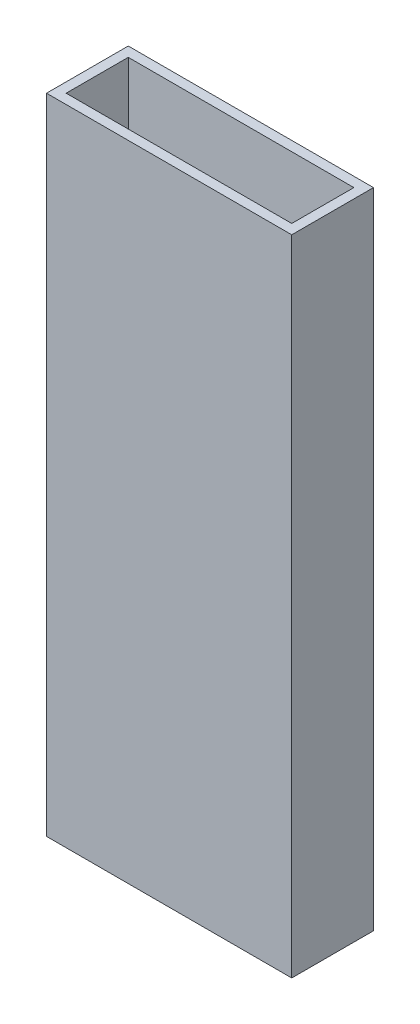
ISO-10303-21;
HEADER;
FILE_DESCRIPTION(('STEP AP214'),'2;1');
FILE_NAME('part.step','',(''),(''),'','','');
FILE_SCHEMA(('AUTOMOTIVE_DESIGN { 1 0 10303 214 1 1 1 1 }'));
ENDSEC;
DATA;
#1=APPLICATION_CONTEXT('core data for automotive mechanical design processes');
#2=APPLICATION_PROTOCOL_DEFINITION('international standard','automotive_design',2000,#1);
#3=PRODUCT_CONTEXT('',#1,'mechanical');
#4=PRODUCT('Part','Part','',(#3));
#5=PRODUCT_RELATED_PRODUCT_CATEGORY('part','',(#4));
#6=PRODUCT_DEFINITION_FORMATION('','',#4);
#7=PRODUCT_DEFINITION_CONTEXT('part definition',#1,'design');
#8=PRODUCT_DEFINITION('design','',#6,#7);
#9=PRODUCT_DEFINITION_SHAPE('','',#8);
#10=(LENGTH_UNIT() NAMED_UNIT(*) SI_UNIT(.MILLI.,.METRE.));
#11=(NAMED_UNIT(*) PLANE_ANGLE_UNIT() SI_UNIT($,.RADIAN.));
#12=(NAMED_UNIT(*) SI_UNIT($,.STERADIAN.) SOLID_ANGLE_UNIT());
#13=UNCERTAINTY_MEASURE_WITH_UNIT(LENGTH_MEASURE(1.E-05),#10,'distance_accuracy_value','');
#14=(GEOMETRIC_REPRESENTATION_CONTEXT(3) GLOBAL_UNCERTAINTY_ASSIGNED_CONTEXT((#13)) GLOBAL_UNIT_ASSIGNED_CONTEXT((#10,
#11,#12)) REPRESENTATION_CONTEXT('',''));
#15=CARTESIAN_POINT('',(0.,0.,0.));
#16=DIRECTION('',(0.,0.,1.));
#17=DIRECTION('',(1.,0.,0.));
#18=AXIS2_PLACEMENT_3D('',#15,#16,#17);
#19=CARTESIAN_POINT('',(0.,200.,0.));
#20=DIRECTION('',(0.,1.,0.));
#21=DIRECTION('',(0.,0.,1.));
#22=AXIS2_PLACEMENT_3D('',#19,#20,#21);
#23=PLANE('',#22);
#24=DIRECTION('',(0.,0.,1.));
#25=VECTOR('',#24,1.);
#26=CARTESIAN_POINT('',(-38.1,200.,-12.7));
#27=LINE('',#26,#25);
#28=CARTESIAN_POINT('',(-38.1,200.,-12.7));
#29=VERTEX_POINT('',#28);
#30=CARTESIAN_POINT('',(-38.1,200.,12.7));
#31=VERTEX_POINT('',#30);
#32=EDGE_CURVE('E153',#29,#31,#27,.T.);
#33=ORIENTED_EDGE('',*,*,#32,.T.);
#34=DIRECTION('',(1.,0.,0.));
#35=VECTOR('',#34,1.);
#36=CARTESIAN_POINT('',(-38.1,200.,12.7));
#37=LINE('',#36,#35);
#38=CARTESIAN_POINT('',(38.1,200.,12.7));
#39=VERTEX_POINT('',#38);
#40=EDGE_CURVE('E157',#31,#39,#37,.T.);
#41=ORIENTED_EDGE('',*,*,#40,.T.);
#42=DIRECTION('',(0.,0.,-1.));
#43=VECTOR('',#42,1.);
#44=CARTESIAN_POINT('',(38.1,200.,-12.7));
#45=LINE('',#44,#43);
#46=CARTESIAN_POINT('',(38.1,200.,-12.7));
#47=VERTEX_POINT('',#46);
#48=EDGE_CURVE('E161',#39,#47,#45,.T.);
#49=ORIENTED_EDGE('',*,*,#48,.T.);
#50=DIRECTION('',(-1.,0.,0.));
#51=VECTOR('',#50,1.);
#52=CARTESIAN_POINT('',(-38.1,200.,-12.7));
#53=LINE('',#52,#51);
#54=EDGE_CURVE('E164',#47,#29,#53,.T.);
#55=ORIENTED_EDGE('',*,*,#54,.T.);
#56=EDGE_LOOP('',(#33,#41,#49,#55));
#57=FACE_BOUND('',#56,.T.);
#58=DIRECTION('',(1.,0.,0.));
#59=VECTOR('',#58,1.);
#60=CARTESIAN_POINT('',(-35.052,200.,9.652));
#61=LINE('',#60,#59);
#62=CARTESIAN_POINT('',(-35.052,200.,9.652));
#63=VERTEX_POINT('',#62);
#64=CARTESIAN_POINT('',(35.052,200.,9.65199999999999));
#65=VERTEX_POINT('',#64);
#66=EDGE_CURVE('E114',#63,#65,#61,.T.);
#67=ORIENTED_EDGE('',*,*,#66,.F.);
#68=DIRECTION('',(0.,0.,1.));
#69=VECTOR('',#68,1.);
#70=CARTESIAN_POINT('',(-35.052,200.,-9.65199999999999));
#71=LINE('',#70,#69);
#72=CARTESIAN_POINT('',(-35.052,200.,-9.65199999999999));
#73=VERTEX_POINT('',#72);
#74=EDGE_CURVE('E105',#73,#63,#71,.T.);
#75=ORIENTED_EDGE('',*,*,#74,.F.);
#76=DIRECTION('',(-1.,0.,0.));
#77=VECTOR('',#76,1.);
#78=CARTESIAN_POINT('',(-35.052,200.,-9.65199999999999));
#79=LINE('',#78,#77);
#80=CARTESIAN_POINT('',(35.052,200.,-9.652));
#81=VERTEX_POINT('',#80);
#82=EDGE_CURVE('E131',#81,#73,#79,.T.);
#83=ORIENTED_EDGE('',*,*,#82,.F.);
#84=DIRECTION('',(0.,0.,-1.));
#85=VECTOR('',#84,1.);
#86=CARTESIAN_POINT('',(35.052,200.,-9.652));
#87=LINE('',#86,#85);
#88=EDGE_CURVE('E127',#65,#81,#87,.T.);
#89=ORIENTED_EDGE('',*,*,#88,.F.);
#90=EDGE_LOOP('',(#67,#75,#83,#89));
#91=FACE_BOUND('',#90,.T.);
#92=ADVANCED_FACE('F39',(#57,#91),#23,.T.);
#93=CARTESIAN_POINT('',(0.,0.,0.));
#94=DIRECTION('',(0.,1.,0.));
#95=DIRECTION('',(0.,0.,1.));
#96=AXIS2_PLACEMENT_3D('',#93,#94,#95);
#97=PLANE('',#96);
#98=DIRECTION('',(0.,0.,1.));
#99=VECTOR('',#98,1.);
#100=CARTESIAN_POINT('',(-38.1,0.,-12.7));
#101=LINE('',#100,#99);
#102=CARTESIAN_POINT('',(-38.1,0.,-12.7));
#103=VERTEX_POINT('',#102);
#104=CARTESIAN_POINT('',(-38.1,0.,12.7));
#105=VERTEX_POINT('',#104);
#106=EDGE_CURVE('E123',#103,#105,#101,.T.);
#107=ORIENTED_EDGE('',*,*,#106,.F.);
#108=DIRECTION('',(-1.,0.,0.));
#109=VECTOR('',#108,1.);
#110=CARTESIAN_POINT('',(-38.1,0.,-12.7));
#111=LINE('',#110,#109);
#112=CARTESIAN_POINT('',(38.1,0.,-12.7));
#113=VERTEX_POINT('',#112);
#114=EDGE_CURVE('E158',#113,#103,#111,.T.);
#115=ORIENTED_EDGE('',*,*,#114,.F.);
#116=DIRECTION('',(0.,0.,-1.));
#117=VECTOR('',#116,1.);
#118=CARTESIAN_POINT('',(38.1,0.,-12.7));
#119=LINE('',#118,#117);
#120=CARTESIAN_POINT('',(38.1,0.,12.7));
#121=VERTEX_POINT('',#120);
#122=EDGE_CURVE('E174',#121,#113,#119,.T.);
#123=ORIENTED_EDGE('',*,*,#122,.F.);
#124=DIRECTION('',(1.,0.,0.));
#125=VECTOR('',#124,1.);
#126=CARTESIAN_POINT('',(-38.1,0.,12.7));
#127=LINE('',#126,#125);
#128=EDGE_CURVE('E171',#105,#121,#127,.T.);
#129=ORIENTED_EDGE('',*,*,#128,.F.);
#130=EDGE_LOOP('',(#107,#115,#123,#129));
#131=FACE_BOUND('',#130,.T.);
#132=DIRECTION('',(0.,0.,1.));
#133=VECTOR('',#132,1.);
#134=CARTESIAN_POINT('',(-35.052,0.,-9.65199999999999));
#135=LINE('',#134,#133);
#136=CARTESIAN_POINT('',(-35.052,0.,-9.65199999999999));
#137=VERTEX_POINT('',#136);
#138=CARTESIAN_POINT('',(-35.052,0.,9.652));
#139=VERTEX_POINT('',#138);
#140=EDGE_CURVE('E63',#137,#139,#135,.T.);
#141=ORIENTED_EDGE('',*,*,#140,.T.);
#142=DIRECTION('',(1.,0.,0.));
#143=VECTOR('',#142,1.);
#144=CARTESIAN_POINT('',(-35.052,0.,9.652));
#145=LINE('',#144,#143);
#146=CARTESIAN_POINT('',(35.052,0.,9.65199999999999));
#147=VERTEX_POINT('',#146);
#148=EDGE_CURVE('E121',#139,#147,#145,.T.);
#149=ORIENTED_EDGE('',*,*,#148,.T.);
#150=DIRECTION('',(0.,0.,-1.));
#151=VECTOR('',#150,1.);
#152=CARTESIAN_POINT('',(35.052,0.,-9.652));
#153=LINE('',#152,#151);
#154=CARTESIAN_POINT('',(35.052,0.,-9.652));
#155=VERTEX_POINT('',#154);
#156=EDGE_CURVE('E140',#147,#155,#153,.T.);
#157=ORIENTED_EDGE('',*,*,#156,.T.);
#158=DIRECTION('',(-1.,0.,0.));
#159=VECTOR('',#158,1.);
#160=CARTESIAN_POINT('',(-35.052,0.,-9.65199999999999));
#161=LINE('',#160,#159);
#162=EDGE_CURVE('E115',#155,#137,#161,.T.);
#163=ORIENTED_EDGE('',*,*,#162,.T.);
#164=EDGE_LOOP('',(#141,#149,#157,#163));
#165=FACE_BOUND('',#164,.T.);
#166=ADVANCED_FACE('F197',(#131,#165),#97,.F.);
#167=CARTESIAN_POINT('',(-38.1,200.,-12.7));
#168=DIRECTION('',(1.,0.,0.));
#169=DIRECTION('',(0.,0.,-1.));
#170=AXIS2_PLACEMENT_3D('',#167,#168,#169);
#171=PLANE('',#170);
#172=ORIENTED_EDGE('',*,*,#106,.T.);
#173=DIRECTION('',(0.,-1.,0.));
#174=VECTOR('',#173,1.);
#175=CARTESIAN_POINT('',(-38.1,200.,12.7));
#176=LINE('',#175,#174);
#177=EDGE_CURVE('E11',#31,#105,#176,.T.);
#178=ORIENTED_EDGE('',*,*,#177,.F.);
#179=ORIENTED_EDGE('',*,*,#32,.F.);
#180=DIRECTION('',(0.,-1.,0.));
#181=VECTOR('',#180,1.);
#182=CARTESIAN_POINT('',(-38.1,200.,-12.7));
#183=LINE('',#182,#181);
#184=EDGE_CURVE('E167',#29,#103,#183,.T.);
#185=ORIENTED_EDGE('',*,*,#184,.T.);
#186=EDGE_LOOP('',(#172,#178,#179,#185));
#187=FACE_BOUND('',#186,.T.);
#188=ADVANCED_FACE('F41',(#187),#171,.F.);
#189=CARTESIAN_POINT('',(-38.1,200.,12.7));
#190=DIRECTION('',(0.,0.,-1.));
#191=DIRECTION('',(-1.,0.,0.));
#192=AXIS2_PLACEMENT_3D('',#189,#190,#191);
#193=PLANE('',#192);
#194=ORIENTED_EDGE('',*,*,#128,.T.);
#195=DIRECTION('',(0.,-1.,0.));
#196=VECTOR('',#195,1.);
#197=CARTESIAN_POINT('',(38.1,200.,12.7));
#198=LINE('',#197,#196);
#199=EDGE_CURVE('E48',#39,#121,#198,.T.);
#200=ORIENTED_EDGE('',*,*,#199,.F.);
#201=ORIENTED_EDGE('',*,*,#40,.F.);
#202=ORIENTED_EDGE('',*,*,#177,.T.);
#203=EDGE_LOOP('',(#194,#200,#201,#202));
#204=FACE_BOUND('',#203,.T.);
#205=ADVANCED_FACE('F207',(#204),#193,.F.);
#206=CARTESIAN_POINT('',(38.1,200.,-12.7));
#207=DIRECTION('',(-1.,0.,0.));
#208=DIRECTION('',(0.,0.,1.));
#209=AXIS2_PLACEMENT_3D('',#206,#207,#208);
#210=PLANE('',#209);
#211=ORIENTED_EDGE('',*,*,#122,.T.);
#212=DIRECTION('',(0.,-1.,0.));
#213=VECTOR('',#212,1.);
#214=CARTESIAN_POINT('',(38.1,200.,-12.7));
#215=LINE('',#214,#213);
#216=EDGE_CURVE('E182',#47,#113,#215,.T.);
#217=ORIENTED_EDGE('',*,*,#216,.F.);
#218=ORIENTED_EDGE('',*,*,#48,.F.);
#219=ORIENTED_EDGE('',*,*,#199,.T.);
#220=EDGE_LOOP('',(#211,#217,#218,#219));
#221=FACE_BOUND('',#220,.T.);
#222=ADVANCED_FACE('F191',(#221),#210,.F.);
#223=CARTESIAN_POINT('',(-38.1,200.,-12.7));
#224=DIRECTION('',(0.,0.,1.));
#225=DIRECTION('',(1.,0.,0.));
#226=AXIS2_PLACEMENT_3D('',#223,#224,#225);
#227=PLANE('',#226);
#228=ORIENTED_EDGE('',*,*,#114,.T.);
#229=ORIENTED_EDGE('',*,*,#184,.F.);
#230=ORIENTED_EDGE('',*,*,#54,.F.);
#231=ORIENTED_EDGE('',*,*,#216,.T.);
#232=EDGE_LOOP('',(#228,#229,#230,#231));
#233=FACE_BOUND('',#232,.T.);
#234=ADVANCED_FACE('F201',(#233),#227,.F.);
#235=CARTESIAN_POINT('',(-35.052,200.,-9.65199999999999));
#236=DIRECTION('',(1.,0.,0.));
#237=DIRECTION('',(0.,0.,-1.));
#238=AXIS2_PLACEMENT_3D('',#235,#236,#237);
#239=PLANE('',#238);
#240=ORIENTED_EDGE('',*,*,#140,.F.);
#241=DIRECTION('',(0.,-1.,0.));
#242=VECTOR('',#241,1.);
#243=CARTESIAN_POINT('',(-35.052,200.,-9.65199999999999));
#244=LINE('',#243,#242);
#245=EDGE_CURVE('E109',#73,#137,#244,.T.);
#246=ORIENTED_EDGE('',*,*,#245,.F.);
#247=ORIENTED_EDGE('',*,*,#74,.T.);
#248=DIRECTION('',(0.,-1.,0.));
#249=VECTOR('',#248,1.);
#250=CARTESIAN_POINT('',(-35.052,200.,9.652));
#251=LINE('',#250,#249);
#252=EDGE_CURVE('E108',#63,#139,#251,.T.);
#253=ORIENTED_EDGE('',*,*,#252,.T.);
#254=EDGE_LOOP('',(#240,#246,#247,#253));
#255=FACE_BOUND('',#254,.T.);
#256=ADVANCED_FACE('F107',(#255),#239,.T.);
#257=CARTESIAN_POINT('',(-35.052,200.,9.652));
#258=DIRECTION('',(0.,0.,-1.));
#259=DIRECTION('',(-1.,0.,0.));
#260=AXIS2_PLACEMENT_3D('',#257,#258,#259);
#261=PLANE('',#260);
#262=ORIENTED_EDGE('',*,*,#148,.F.);
#263=ORIENTED_EDGE('',*,*,#252,.F.);
#264=ORIENTED_EDGE('',*,*,#66,.T.);
#265=DIRECTION('',(0.,-1.,0.));
#266=VECTOR('',#265,1.);
#267=CARTESIAN_POINT('',(35.052,200.,9.65199999999999));
#268=LINE('',#267,#266);
#269=EDGE_CURVE('E124',#65,#147,#268,.T.);
#270=ORIENTED_EDGE('',*,*,#269,.T.);
#271=EDGE_LOOP('',(#262,#263,#264,#270));
#272=FACE_BOUND('',#271,.T.);
#273=ADVANCED_FACE('F118',(#272),#261,.T.);
#274=CARTESIAN_POINT('',(35.052,200.,-9.652));
#275=DIRECTION('',(-1.,0.,0.));
#276=DIRECTION('',(0.,0.,1.));
#277=AXIS2_PLACEMENT_3D('',#274,#275,#276);
#278=PLANE('',#277);
#279=ORIENTED_EDGE('',*,*,#156,.F.);
#280=ORIENTED_EDGE('',*,*,#269,.F.);
#281=ORIENTED_EDGE('',*,*,#88,.T.);
#282=DIRECTION('',(0.,-1.,0.));
#283=VECTOR('',#282,1.);
#284=CARTESIAN_POINT('',(35.052,200.,-9.652));
#285=LINE('',#284,#283);
#286=EDGE_CURVE('E55',#81,#155,#285,.T.);
#287=ORIENTED_EDGE('',*,*,#286,.T.);
#288=EDGE_LOOP('',(#279,#280,#281,#287));
#289=FACE_BOUND('',#288,.T.);
#290=ADVANCED_FACE('F230',(#289),#278,.T.);
#291=CARTESIAN_POINT('',(-35.052,200.,-9.65199999999999));
#292=DIRECTION('',(0.,0.,1.));
#293=DIRECTION('',(1.,0.,0.));
#294=AXIS2_PLACEMENT_3D('',#291,#292,#293);
#295=PLANE('',#294);
#296=ORIENTED_EDGE('',*,*,#162,.F.);
#297=ORIENTED_EDGE('',*,*,#286,.F.);
#298=ORIENTED_EDGE('',*,*,#82,.T.);
#299=ORIENTED_EDGE('',*,*,#245,.T.);
#300=EDGE_LOOP('',(#296,#297,#298,#299));
#301=FACE_BOUND('',#300,.T.);
#302=ADVANCED_FACE('F234',(#301),#295,.T.);
#303=CLOSED_SHELL('',(#92,#166,#188,#205,#222,#234,#256,#273,#290,#302));
#304=MANIFOLD_SOLID_BREP('B2',#303);
#305=ADVANCED_BREP_SHAPE_REPRESENTATION('',(#18,#304),#14);
#306=SHAPE_DEFINITION_REPRESENTATION(#9,#305);
ENDSEC;
END-ISO-10303-21;
